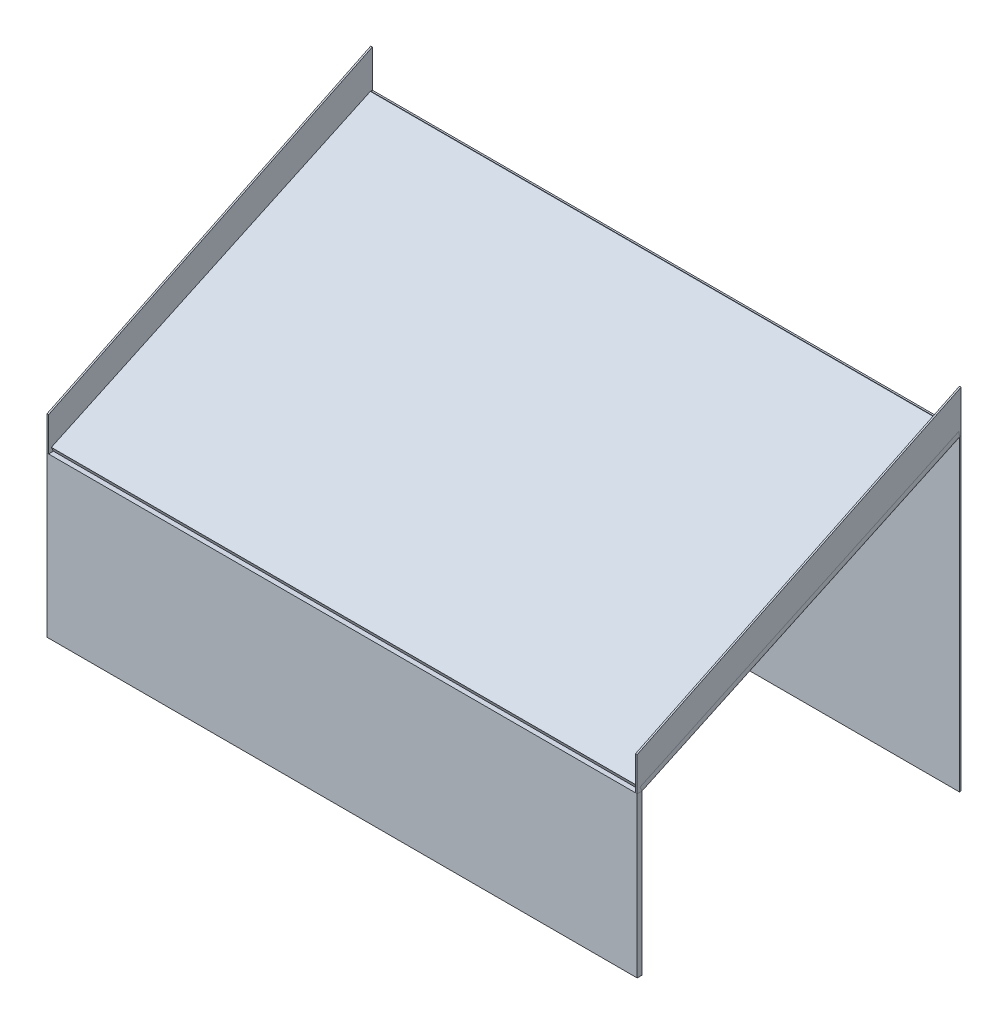
ISO-10303-21;
HEADER;
FILE_DESCRIPTION(('STEP AP214'),'2;1');
FILE_NAME('part.step','',(''),(''),'','','');
FILE_SCHEMA(('AUTOMOTIVE_DESIGN { 1 0 10303 214 1 1 1 1 }'));
ENDSEC;
DATA;
#1=APPLICATION_CONTEXT('core data for automotive mechanical design processes');
#2=APPLICATION_PROTOCOL_DEFINITION('international standard','automotive_design',2000,#1);
#3=PRODUCT_CONTEXT('',#1,'mechanical');
#4=PRODUCT('Part','Part','',(#3));
#5=PRODUCT_RELATED_PRODUCT_CATEGORY('part','',(#4));
#6=PRODUCT_DEFINITION_FORMATION('','',#4);
#7=PRODUCT_DEFINITION_CONTEXT('part definition',#1,'design');
#8=PRODUCT_DEFINITION('design','',#6,#7);
#9=PRODUCT_DEFINITION_SHAPE('','',#8);
#10=(LENGTH_UNIT() NAMED_UNIT(*) SI_UNIT(.MILLI.,.METRE.));
#11=(NAMED_UNIT(*) PLANE_ANGLE_UNIT() SI_UNIT($,.RADIAN.));
#12=(NAMED_UNIT(*) SI_UNIT($,.STERADIAN.) SOLID_ANGLE_UNIT());
#13=UNCERTAINTY_MEASURE_WITH_UNIT(LENGTH_MEASURE(1.E-05),#10,'distance_accuracy_value','');
#14=(GEOMETRIC_REPRESENTATION_CONTEXT(3) GLOBAL_UNCERTAINTY_ASSIGNED_CONTEXT((#13)) GLOBAL_UNIT_ASSIGNED_CONTEXT((#10,
#11,#12)) REPRESENTATION_CONTEXT('',''));
#15=CARTESIAN_POINT('',(0.,0.,0.));
#16=DIRECTION('',(0.,0.,1.));
#17=DIRECTION('',(1.,0.,0.));
#18=AXIS2_PLACEMENT_3D('',#15,#16,#17);
#19=CARTESIAN_POINT('',(-184.,121.325535704581,103.));
#20=DIRECTION('',(0.,0.,1.));
#21=DIRECTION('',(1.,0.,0.));
#22=AXIS2_PLACEMENT_3D('',#19,#20,#21);
#23=PLANE('',#22);
#24=DIRECTION('',(0.,1.,0.));
#25=VECTOR('',#24,1.);
#26=CARTESIAN_POINT('',(-185.,121.325535704581,103.));
#27=LINE('',#26,#25);
#28=CARTESIAN_POINT('',(-185.,100.,103.));
#29=VERTEX_POINT('',#28);
#30=CARTESIAN_POINT('',(-185.,121.325535704581,103.));
#31=VERTEX_POINT('',#30);
#32=EDGE_CURVE('E123',#29,#31,#27,.T.);
#33=ORIENTED_EDGE('',*,*,#32,.F.);
#34=DIRECTION('',(-1.,0.,0.));
#35=VECTOR('',#34,1.);
#36=CARTESIAN_POINT('',(-184.,100.,103.));
#37=LINE('',#36,#35);
#38=CARTESIAN_POINT('',(-184.,100.,103.));
#39=VERTEX_POINT('',#38);
#40=EDGE_CURVE('E12',#39,#29,#37,.T.);
#41=ORIENTED_EDGE('',*,*,#40,.F.);
#42=DIRECTION('',(0.,1.,0.));
#43=VECTOR('',#42,1.);
#44=CARTESIAN_POINT('',(-184.,121.325535704581,103.));
#45=LINE('',#44,#43);
#46=CARTESIAN_POINT('',(-184.,121.325535704581,103.));
#47=VERTEX_POINT('',#46);
#48=EDGE_CURVE('E118',#39,#47,#45,.T.);
#49=ORIENTED_EDGE('',*,*,#48,.T.);
#50=DIRECTION('',(-1.,0.,0.));
#51=VECTOR('',#50,1.);
#52=CARTESIAN_POINT('',(-184.,121.325535704581,103.));
#53=LINE('',#52,#51);
#54=EDGE_CURVE('E49',#47,#31,#53,.T.);
#55=ORIENTED_EDGE('',*,*,#54,.T.);
#56=EDGE_LOOP('',(#33,#41,#49,#55));
#57=FACE_BOUND('',#56,.T.);
#58=ADVANCED_FACE('F46',(#57),#23,.T.);
#59=CARTESIAN_POINT('',(-184.,100.,103.));
#60=DIRECTION('',(0.,-1.,0.));
#61=DIRECTION('',(0.,0.,-1.));
#62=AXIS2_PLACEMENT_3D('',#59,#60,#61);
#63=PLANE('',#62);
#64=DIRECTION('',(0.,0.,1.));
#65=VECTOR('',#64,1.);
#66=CARTESIAN_POINT('',(-185.,100.,103.));
#67=LINE('',#66,#65);
#68=CARTESIAN_POINT('',(-185.,100.,100.));
#69=VERTEX_POINT('',#68);
#70=EDGE_CURVE('E132',#69,#29,#67,.T.);
#71=ORIENTED_EDGE('',*,*,#70,.F.);
#72=DIRECTION('',(-1.,0.,0.));
#73=VECTOR('',#72,1.);
#74=CARTESIAN_POINT('',(-184.,100.,100.));
#75=LINE('',#74,#73);
#76=CARTESIAN_POINT('',(-184.,100.,100.));
#77=VERTEX_POINT('',#76);
#78=EDGE_CURVE('E55',#77,#69,#75,.T.);
#79=ORIENTED_EDGE('',*,*,#78,.F.);
#80=DIRECTION('',(0.,0.,1.));
#81=VECTOR('',#80,1.);
#82=CARTESIAN_POINT('',(-184.,100.,103.));
#83=LINE('',#82,#81);
#84=EDGE_CURVE('E113',#77,#39,#83,.T.);
#85=ORIENTED_EDGE('',*,*,#84,.T.);
#86=ORIENTED_EDGE('',*,*,#40,.T.);
#87=EDGE_LOOP('',(#71,#79,#85,#86));
#88=FACE_BOUND('',#87,.T.);
#89=ADVANCED_FACE('F138',(#88),#63,.T.);
#90=CARTESIAN_POINT('',(-184.,100.,100.));
#91=DIRECTION('',(0.,-0.906614748039815,-0.421959356617084));
#92=DIRECTION('',(0.,0.421959356617084,-0.906614748039815));
#93=AXIS2_PLACEMENT_3D('',#90,#91,#92);
#94=PLANE('',#93);
#95=DIRECTION('',(0.,-0.421959356617084,0.906614748039815));
#96=VECTOR('',#95,1.);
#97=CARTESIAN_POINT('',(-185.,100.,100.));
#98=LINE('',#97,#96);
#99=CARTESIAN_POINT('',(-185.,193.084600163277,-100.));
#100=VERTEX_POINT('',#99);
#101=EDGE_CURVE('E102',#100,#69,#98,.T.);
#102=ORIENTED_EDGE('',*,*,#101,.F.);
#103=DIRECTION('',(-1.,0.,0.));
#104=VECTOR('',#103,1.);
#105=CARTESIAN_POINT('',(-184.,193.084600163277,-100.));
#106=LINE('',#105,#104);
#107=CARTESIAN_POINT('',(-184.,193.084600163277,-100.));
#108=VERTEX_POINT('',#107);
#109=EDGE_CURVE('E97',#108,#100,#106,.T.);
#110=ORIENTED_EDGE('',*,*,#109,.F.);
#111=DIRECTION('',(0.,-0.421959356617084,0.906614748039815));
#112=VECTOR('',#111,1.);
#113=CARTESIAN_POINT('',(-184.,100.,100.));
#114=LINE('',#113,#112);
#115=EDGE_CURVE('E100',#108,#77,#114,.T.);
#116=ORIENTED_EDGE('',*,*,#115,.T.);
#117=ORIENTED_EDGE('',*,*,#78,.T.);
#118=EDGE_LOOP('',(#102,#110,#116,#117));
#119=FACE_BOUND('',#118,.T.);
#120=ADVANCED_FACE('F99',(#119),#94,.T.);
#121=CARTESIAN_POINT('',(-184.,193.084600163277,-100.));
#122=DIRECTION('',(0.,0.,-1.));
#123=DIRECTION('',(-1.,0.,0.));
#124=AXIS2_PLACEMENT_3D('',#121,#122,#123);
#125=PLANE('',#124);
#126=DIRECTION('',(0.,-1.,0.));
#127=VECTOR('',#126,1.);
#128=CARTESIAN_POINT('',(-185.,193.084600163277,-100.));
#129=LINE('',#128,#127);
#130=CARTESIAN_POINT('',(-185.,219.473901999794,-100.));
#131=VERTEX_POINT('',#130);
#132=EDGE_CURVE('E129',#131,#100,#129,.T.);
#133=ORIENTED_EDGE('',*,*,#132,.F.);
#134=DIRECTION('',(-1.,0.,0.));
#135=VECTOR('',#134,1.);
#136=CARTESIAN_POINT('',(-184.,219.473901999794,-100.));
#137=LINE('',#136,#135);
#138=CARTESIAN_POINT('',(-184.,219.473901999794,-100.));
#139=VERTEX_POINT('',#138);
#140=EDGE_CURVE('E107',#139,#131,#137,.T.);
#141=ORIENTED_EDGE('',*,*,#140,.F.);
#142=DIRECTION('',(0.,-1.,0.));
#143=VECTOR('',#142,1.);
#144=CARTESIAN_POINT('',(-184.,193.084600163277,-100.));
#145=LINE('',#144,#143);
#146=EDGE_CURVE('E112',#139,#108,#145,.T.);
#147=ORIENTED_EDGE('',*,*,#146,.T.);
#148=ORIENTED_EDGE('',*,*,#109,.T.);
#149=EDGE_LOOP('',(#133,#141,#147,#148));
#150=FACE_BOUND('',#149,.T.);
#151=ADVANCED_FACE('F115',(#150),#125,.T.);
#152=CARTESIAN_POINT('',(-184.,219.473901999794,-100.));
#153=DIRECTION('',(0.,0.900293863477287,0.435282620127591));
#154=DIRECTION('',(0.,-0.435282620127591,0.900293863477287));
#155=AXIS2_PLACEMENT_3D('',#152,#153,#154);
#156=PLANE('',#155);
#157=DIRECTION('',(0.,0.435282620127591,-0.900293863477287));
#158=VECTOR('',#157,1.);
#159=CARTESIAN_POINT('',(-185.,219.473901999794,-100.));
#160=LINE('',#159,#158);
#161=EDGE_CURVE('E126',#31,#131,#160,.T.);
#162=ORIENTED_EDGE('',*,*,#161,.F.);
#163=ORIENTED_EDGE('',*,*,#54,.F.);
#164=DIRECTION('',(0.,0.435282620127591,-0.900293863477287));
#165=VECTOR('',#164,1.);
#166=CARTESIAN_POINT('',(-184.,219.473901999794,-100.));
#167=LINE('',#166,#165);
#168=EDGE_CURVE('E116',#47,#139,#167,.T.);
#169=ORIENTED_EDGE('',*,*,#168,.T.);
#170=ORIENTED_EDGE('',*,*,#140,.T.);
#171=EDGE_LOOP('',(#162,#163,#169,#170));
#172=FACE_BOUND('',#171,.T.);
#173=ADVANCED_FACE('F135',(#172),#156,.T.);
#174=CARTESIAN_POINT('',(-184.,0.,0.));
#175=DIRECTION('',(1.,0.,0.));
#176=DIRECTION('',(0.,0.,-1.));
#177=AXIS2_PLACEMENT_3D('',#174,#175,#176);
#178=PLANE('',#177);
#179=ORIENTED_EDGE('',*,*,#48,.F.);
#180=ORIENTED_EDGE('',*,*,#84,.F.);
#181=ORIENTED_EDGE('',*,*,#115,.F.);
#182=ORIENTED_EDGE('',*,*,#146,.F.);
#183=ORIENTED_EDGE('',*,*,#168,.F.);
#184=EDGE_LOOP('',(#179,#180,#181,#182,#183));
#185=FACE_BOUND('',#184,.T.);
#186=ADVANCED_FACE('F111',(#185),#178,.T.);
#187=CARTESIAN_POINT('',(-185.,0.,0.));
#188=DIRECTION('',(1.,0.,0.));
#189=DIRECTION('',(0.,0.,-1.));
#190=AXIS2_PLACEMENT_3D('',#187,#188,#189);
#191=PLANE('',#190);
#192=ORIENTED_EDGE('',*,*,#32,.T.);
#193=ORIENTED_EDGE('',*,*,#161,.T.);
#194=ORIENTED_EDGE('',*,*,#132,.T.);
#195=ORIENTED_EDGE('',*,*,#101,.T.);
#196=ORIENTED_EDGE('',*,*,#70,.T.);
#197=EDGE_LOOP('',(#192,#193,#194,#195,#196));
#198=FACE_BOUND('',#197,.T.);
#199=ADVANCED_FACE('F137',(#198),#191,.F.);
#200=CLOSED_SHELL('',(#58,#89,#120,#151,#173,#186,#199));
#201=MANIFOLD_SOLID_BREP('B2',#200);
#202=CARTESIAN_POINT('',(184.,100.,100.));
#203=DIRECTION('',(0.,-1.,0.));
#204=DIRECTION('',(0.,0.,-1.));
#205=AXIS2_PLACEMENT_3D('',#202,#203,#204);
#206=PLANE('',#205);
#207=DIRECTION('',(0.,0.,-1.));
#208=VECTOR('',#207,1.);
#209=CARTESIAN_POINT('',(185.,100.,100.));
#210=LINE('',#209,#208);
#211=CARTESIAN_POINT('',(185.,100.,103.));
#212=VERTEX_POINT('',#211);
#213=CARTESIAN_POINT('',(185.,100.,100.));
#214=VERTEX_POINT('',#213);
#215=EDGE_CURVE('E283',#212,#214,#210,.T.);
#216=ORIENTED_EDGE('',*,*,#215,.F.);
#217=DIRECTION('',(1.,0.,0.));
#218=VECTOR('',#217,1.);
#219=CARTESIAN_POINT('',(184.,100.,103.));
#220=LINE('',#219,#218);
#221=CARTESIAN_POINT('',(184.,100.,103.));
#222=VERTEX_POINT('',#221);
#223=EDGE_CURVE('E44',#222,#212,#220,.T.);
#224=ORIENTED_EDGE('',*,*,#223,.F.);
#225=DIRECTION('',(0.,0.,-1.));
#226=VECTOR('',#225,1.);
#227=CARTESIAN_POINT('',(184.,100.,100.));
#228=LINE('',#227,#226);
#229=CARTESIAN_POINT('',(184.,100.,100.));
#230=VERTEX_POINT('',#229);
#231=EDGE_CURVE('E278',#222,#230,#228,.T.);
#232=ORIENTED_EDGE('',*,*,#231,.T.);
#233=DIRECTION('',(1.,0.,0.));
#234=VECTOR('',#233,1.);
#235=CARTESIAN_POINT('',(184.,100.,100.));
#236=LINE('',#235,#234);
#237=EDGE_CURVE('E209',#230,#214,#236,.T.);
#238=ORIENTED_EDGE('',*,*,#237,.T.);
#239=EDGE_LOOP('',(#216,#224,#232,#238));
#240=FACE_BOUND('',#239,.T.);
#241=ADVANCED_FACE('F206',(#240),#206,.T.);
#242=CARTESIAN_POINT('',(184.,100.,103.));
#243=DIRECTION('',(0.,0.,1.));
#244=DIRECTION('',(1.,0.,0.));
#245=AXIS2_PLACEMENT_3D('',#242,#243,#244);
#246=PLANE('',#245);
#247=DIRECTION('',(0.,-1.,0.));
#248=VECTOR('',#247,1.);
#249=CARTESIAN_POINT('',(185.,100.,103.));
#250=LINE('',#249,#248);
#251=CARTESIAN_POINT('',(185.,121.325535704581,103.));
#252=VERTEX_POINT('',#251);
#253=EDGE_CURVE('E292',#252,#212,#250,.T.);
#254=ORIENTED_EDGE('',*,*,#253,.F.);
#255=DIRECTION('',(1.,0.,0.));
#256=VECTOR('',#255,1.);
#257=CARTESIAN_POINT('',(184.,121.325535704581,103.));
#258=LINE('',#257,#256);
#259=CARTESIAN_POINT('',(184.,121.325535704581,103.));
#260=VERTEX_POINT('',#259);
#261=EDGE_CURVE('E215',#260,#252,#258,.T.);
#262=ORIENTED_EDGE('',*,*,#261,.F.);
#263=DIRECTION('',(0.,-1.,0.));
#264=VECTOR('',#263,1.);
#265=CARTESIAN_POINT('',(184.,100.,103.));
#266=LINE('',#265,#264);
#267=EDGE_CURVE('E273',#260,#222,#266,.T.);
#268=ORIENTED_EDGE('',*,*,#267,.T.);
#269=ORIENTED_EDGE('',*,*,#223,.T.);
#270=EDGE_LOOP('',(#254,#262,#268,#269));
#271=FACE_BOUND('',#270,.T.);
#272=ADVANCED_FACE('F298',(#271),#246,.T.);
#273=CARTESIAN_POINT('',(184.,121.325535704581,103.));
#274=DIRECTION('',(0.,0.900676274518,0.434490792215872));
#275=DIRECTION('',(0.,-0.434490792215872,0.900676274518));
#276=AXIS2_PLACEMENT_3D('',#273,#274,#275);
#277=PLANE('',#276);
#278=DIRECTION('',(0.,-0.434490792215872,0.900676274518));
#279=VECTOR('',#278,1.);
#280=CARTESIAN_POINT('',(185.,121.325535704581,103.));
#281=LINE('',#280,#279);
#282=CARTESIAN_POINT('',(185.,219.253762877017,-100.));
#283=VERTEX_POINT('',#282);
#284=EDGE_CURVE('E262',#283,#252,#281,.T.);
#285=ORIENTED_EDGE('',*,*,#284,.F.);
#286=DIRECTION('',(1.,0.,0.));
#287=VECTOR('',#286,1.);
#288=CARTESIAN_POINT('',(184.,219.253762877017,-100.));
#289=LINE('',#288,#287);
#290=CARTESIAN_POINT('',(184.,219.253762877017,-100.));
#291=VERTEX_POINT('',#290);
#292=EDGE_CURVE('E257',#291,#283,#289,.T.);
#293=ORIENTED_EDGE('',*,*,#292,.F.);
#294=DIRECTION('',(0.,-0.434490792215872,0.900676274518));
#295=VECTOR('',#294,1.);
#296=CARTESIAN_POINT('',(184.,121.325535704581,103.));
#297=LINE('',#296,#295);
#298=EDGE_CURVE('E260',#291,#260,#297,.T.);
#299=ORIENTED_EDGE('',*,*,#298,.T.);
#300=ORIENTED_EDGE('',*,*,#261,.T.);
#301=EDGE_LOOP('',(#285,#293,#299,#300));
#302=FACE_BOUND('',#301,.T.);
#303=ADVANCED_FACE('F259',(#302),#277,.T.);
#304=CARTESIAN_POINT('',(184.,219.253762877017,-100.));
#305=DIRECTION('',(0.,0.,-1.));
#306=DIRECTION('',(-1.,0.,0.));
#307=AXIS2_PLACEMENT_3D('',#304,#305,#306);
#308=PLANE('',#307);
#309=DIRECTION('',(0.,1.,0.));
#310=VECTOR('',#309,1.);
#311=CARTESIAN_POINT('',(185.,219.253762877017,-100.));
#312=LINE('',#311,#310);
#313=CARTESIAN_POINT('',(185.,193.084600163277,-100.));
#314=VERTEX_POINT('',#313);
#315=EDGE_CURVE('E289',#314,#283,#312,.T.);
#316=ORIENTED_EDGE('',*,*,#315,.F.);
#317=DIRECTION('',(1.,0.,0.));
#318=VECTOR('',#317,1.);
#319=CARTESIAN_POINT('',(184.,193.084600163277,-100.));
#320=LINE('',#319,#318);
#321=CARTESIAN_POINT('',(184.,193.084600163277,-100.));
#322=VERTEX_POINT('',#321);
#323=EDGE_CURVE('E267',#322,#314,#320,.T.);
#324=ORIENTED_EDGE('',*,*,#323,.F.);
#325=DIRECTION('',(0.,1.,0.));
#326=VECTOR('',#325,1.);
#327=CARTESIAN_POINT('',(184.,219.253762877017,-100.));
#328=LINE('',#327,#326);
#329=EDGE_CURVE('E272',#322,#291,#328,.T.);
#330=ORIENTED_EDGE('',*,*,#329,.T.);
#331=ORIENTED_EDGE('',*,*,#292,.T.);
#332=EDGE_LOOP('',(#316,#324,#330,#331));
#333=FACE_BOUND('',#332,.T.);
#334=ADVANCED_FACE('F275',(#333),#308,.T.);
#335=CARTESIAN_POINT('',(184.,193.084600163277,-100.));
#336=DIRECTION('',(0.,-0.906614748039815,-0.421959356617084));
#337=DIRECTION('',(0.,0.421959356617084,-0.906614748039815));
#338=AXIS2_PLACEMENT_3D('',#335,#336,#337);
#339=PLANE('',#338);
#340=DIRECTION('',(0.,0.421959356617084,-0.906614748039815));
#341=VECTOR('',#340,1.);
#342=CARTESIAN_POINT('',(185.,193.084600163277,-100.));
#343=LINE('',#342,#341);
#344=EDGE_CURVE('E286',#214,#314,#343,.T.);
#345=ORIENTED_EDGE('',*,*,#344,.F.);
#346=ORIENTED_EDGE('',*,*,#237,.F.);
#347=DIRECTION('',(0.,0.421959356617084,-0.906614748039815));
#348=VECTOR('',#347,1.);
#349=CARTESIAN_POINT('',(184.,193.084600163277,-100.));
#350=LINE('',#349,#348);
#351=EDGE_CURVE('E276',#230,#322,#350,.T.);
#352=ORIENTED_EDGE('',*,*,#351,.T.);
#353=ORIENTED_EDGE('',*,*,#323,.T.);
#354=EDGE_LOOP('',(#345,#346,#352,#353));
#355=FACE_BOUND('',#354,.T.);
#356=ADVANCED_FACE('F295',(#355),#339,.T.);
#357=CARTESIAN_POINT('',(184.,0.,0.));
#358=DIRECTION('',(-1.,0.,0.));
#359=DIRECTION('',(0.,0.,1.));
#360=AXIS2_PLACEMENT_3D('',#357,#358,#359);
#361=PLANE('',#360);
#362=ORIENTED_EDGE('',*,*,#231,.F.);
#363=ORIENTED_EDGE('',*,*,#267,.F.);
#364=ORIENTED_EDGE('',*,*,#298,.F.);
#365=ORIENTED_EDGE('',*,*,#329,.F.);
#366=ORIENTED_EDGE('',*,*,#351,.F.);
#367=EDGE_LOOP('',(#362,#363,#364,#365,#366));
#368=FACE_BOUND('',#367,.T.);
#369=ADVANCED_FACE('F271',(#368),#361,.T.);
#370=CARTESIAN_POINT('',(185.,0.,0.));
#371=DIRECTION('',(-1.,0.,0.));
#372=DIRECTION('',(0.,0.,1.));
#373=AXIS2_PLACEMENT_3D('',#370,#371,#372);
#374=PLANE('',#373);
#375=ORIENTED_EDGE('',*,*,#215,.T.);
#376=ORIENTED_EDGE('',*,*,#344,.T.);
#377=ORIENTED_EDGE('',*,*,#315,.T.);
#378=ORIENTED_EDGE('',*,*,#284,.T.);
#379=ORIENTED_EDGE('',*,*,#253,.T.);
#380=EDGE_LOOP('',(#375,#376,#377,#378,#379));
#381=FACE_BOUND('',#380,.T.);
#382=ADVANCED_FACE('F297',(#381),#374,.F.);
#383=CLOSED_SHELL('',(#241,#272,#303,#334,#356,#369,#382));
#384=MANIFOLD_SOLID_BREP('B6',#383);
#385=CARTESIAN_POINT('',(-185.,195.980454992108,-98.7321452147779));
#386=DIRECTION('',(0.,-0.422618261740694,0.906307787036652));
#387=DIRECTION('',(0.,-0.906307787036652,-0.422618261740694));
#388=AXIS2_PLACEMENT_3D('',#385,#386,#387);
#389=PLANE('',#388);
#390=DIRECTION('',(1.,0.,0.));
#391=VECTOR('',#390,1.);
#392=CARTESIAN_POINT('',(-185.,195.406038551508,-99.));
#393=LINE('',#392,#391);
#394=CARTESIAN_POINT('',(-185.,195.406038551508,-99.));
#395=VERTEX_POINT('',#394);
#396=CARTESIAN_POINT('',(185.,195.406038551508,-99.));
#397=VERTEX_POINT('',#396);
#398=EDGE_CURVE('E384',#395,#397,#393,.T.);
#399=ORIENTED_EDGE('',*,*,#398,.F.);
#400=DIRECTION('',(0.,-0.906307787036652,-0.422618261740694));
#401=VECTOR('',#400,1.);
#402=CARTESIAN_POINT('',(-185.,195.980454992108,-98.7321452147779));
#403=LINE('',#402,#401);
#404=CARTESIAN_POINT('',(-185.,195.980454992108,-98.7321452147779));
#405=VERTEX_POINT('',#404);
#406=EDGE_CURVE('E495',#405,#395,#403,.T.);
#407=ORIENTED_EDGE('',*,*,#406,.F.);
#408=DIRECTION('',(-1.,0.,0.));
#409=VECTOR('',#408,1.);
#410=CARTESIAN_POINT('',(-185.,195.980454992108,-98.7321452147779));
#411=LINE('',#410,#409);
#412=CARTESIAN_POINT('',(185.,195.980454992108,-98.7321452147779));
#413=VERTEX_POINT('',#412);
#414=EDGE_CURVE('E493',#413,#405,#411,.T.);
#415=ORIENTED_EDGE('',*,*,#414,.F.);
#416=DIRECTION('',(0.,-0.906307787036652,-0.422618261740694));
#417=VECTOR('',#416,1.);
#418=CARTESIAN_POINT('',(185.,195.980454992108,-98.7321452147779));
#419=LINE('',#418,#417);
#420=EDGE_CURVE('E380',#413,#397,#419,.T.);
#421=ORIENTED_EDGE('',*,*,#420,.T.);
#422=EDGE_LOOP('',(#399,#407,#415,#421));
#423=FACE_BOUND('',#422,.T.);
#424=ADVANCED_FACE('F365',(#423),#389,.F.);
#425=CARTESIAN_POINT('',(0.,120.441602640276,56.162841671621));
#426=DIRECTION('',(0.,0.906307787036652,0.422618261740694));
#427=DIRECTION('',(0.,-0.422618261740694,0.906307787036652));
#428=AXIS2_PLACEMENT_3D('',#425,#426,#427);
#429=PLANE('',#428);
#430=DIRECTION('',(-1.,0.,0.));
#431=VECTOR('',#430,1.);
#432=CARTESIAN_POINT('',(0.,192.795223972843,-99.));
#433=LINE('',#432,#431);
#434=CARTESIAN_POINT('',(185.,192.795223972843,-99.));
#435=VERTEX_POINT('',#434);
#436=CARTESIAN_POINT('',(-185.,192.795223972843,-99.));
#437=VERTEX_POINT('',#436);
#438=EDGE_CURVE('E204',#435,#437,#433,.T.);
#439=ORIENTED_EDGE('',*,*,#438,.F.);
#440=DIRECTION('',(0.,0.422618261740694,-0.906307787036652));
#441=VECTOR('',#440,1.);
#442=CARTESIAN_POINT('',(185.,193.261531630998,-100.));
#443=LINE('',#442,#441);
#444=CARTESIAN_POINT('',(185.,99.9999999999999,100.));
#445=VERTEX_POINT('',#444);
#446=EDGE_CURVE('E444',#445,#435,#443,.T.);
#447=ORIENTED_EDGE('',*,*,#446,.F.);
#448=DIRECTION('',(1.,0.,0.));
#449=VECTOR('',#448,1.);
#450=CARTESIAN_POINT('',(-185.,99.9999999999999,100.));
#451=LINE('',#450,#449);
#452=CARTESIAN_POINT('',(-185.,99.9999999999999,100.));
#453=VERTEX_POINT('',#452);
#454=EDGE_CURVE('E497',#453,#445,#451,.T.);
#455=ORIENTED_EDGE('',*,*,#454,.F.);
#456=DIRECTION('',(0.,-0.422618261740694,0.906307787036652));
#457=VECTOR('',#456,1.);
#458=CARTESIAN_POINT('',(-185.,193.261531630998,-100.));
#459=LINE('',#458,#457);
#460=EDGE_CURVE('E485',#437,#453,#459,.T.);
#461=ORIENTED_EDGE('',*,*,#460,.F.);
#462=EDGE_LOOP('',(#439,#447,#455,#461));
#463=FACE_BOUND('',#462,.T.);
#464=ADVANCED_FACE('F512',(#463),#429,.F.);
#465=CARTESIAN_POINT('',(-185.,195.980454992108,-98.7321452147779));
#466=DIRECTION('',(1.,0.,0.));
#467=DIRECTION('',(0.,0.,-1.));
#468=AXIS2_PLACEMENT_3D('',#465,#466,#467);
#469=PLANE('',#468);
#470=DIRECTION('',(0.,1.,0.));
#471=VECTOR('',#470,1.);
#472=CARTESIAN_POINT('',(-185.,195.980454992108,-99.));
#473=LINE('',#472,#471);
#474=CARTESIAN_POINT('',(-185.,0.,-99.));
#475=VERTEX_POINT('',#474);
#476=EDGE_CURVE('E462',#475,#437,#473,.T.);
#477=ORIENTED_EDGE('',*,*,#476,.T.);
#478=ORIENTED_EDGE('',*,*,#460,.T.);
#479=DIRECTION('',(0.,-0.906307787036652,-0.422618261740694));
#480=VECTOR('',#479,1.);
#481=CARTESIAN_POINT('',(-185.,102.71892336111,101.267854785222));
#482=LINE('',#481,#480);
#483=CARTESIAN_POINT('',(-185.,102.71892336111,101.267854785222));
#484=VERTEX_POINT('',#483);
#485=EDGE_CURVE('E373',#484,#453,#482,.T.);
#486=ORIENTED_EDGE('',*,*,#485,.F.);
#487=DIRECTION('',(0.,-0.422618261740694,0.906307787036652));
#488=VECTOR('',#487,1.);
#489=CARTESIAN_POINT('',(-185.,195.980454992108,-98.7321452147779));
#490=LINE('',#489,#488);
#491=EDGE_CURVE('E486',#405,#484,#490,.T.);
#492=ORIENTED_EDGE('',*,*,#491,.F.);
#493=ORIENTED_EDGE('',*,*,#406,.T.);
#494=CARTESIAN_POINT('',(-185.,195.980454992108,-99.));
#495=VERTEX_POINT('',#494);
#496=EDGE_CURVE('E463',#395,#495,#473,.T.);
#497=ORIENTED_EDGE('',*,*,#496,.T.);
#498=DIRECTION('',(0.,0.,-1.));
#499=VECTOR('',#498,1.);
#500=CARTESIAN_POINT('',(-185.,195.980454992108,-99.));
#501=LINE('',#500,#499);
#502=CARTESIAN_POINT('',(-185.,195.980454992108,-100.));
#503=VERTEX_POINT('',#502);
#504=EDGE_CURVE('E480',#495,#503,#501,.T.);
#505=ORIENTED_EDGE('',*,*,#504,.T.);
#506=DIRECTION('',(0.,1.,0.));
#507=VECTOR('',#506,1.);
#508=CARTESIAN_POINT('',(-185.,195.980454992108,-100.));
#509=LINE('',#508,#507);
#510=CARTESIAN_POINT('',(-185.,0.,-100.));
#511=VERTEX_POINT('',#510);
#512=EDGE_CURVE('E473',#511,#503,#509,.T.);
#513=ORIENTED_EDGE('',*,*,#512,.F.);
#514=DIRECTION('',(0.,0.,-1.));
#515=VECTOR('',#514,1.);
#516=CARTESIAN_POINT('',(-185.,0.,-99.));
#517=LINE('',#516,#515);
#518=EDGE_CURVE('E456',#475,#511,#517,.T.);
#519=ORIENTED_EDGE('',*,*,#518,.F.);
#520=EDGE_LOOP('',(#477,#478,#486,#492,#493,#497,#505,#513,#519));
#521=FACE_BOUND('',#520,.T.);
#522=ADVANCED_FACE('F367',(#521),#469,.F.);
#523=CARTESIAN_POINT('',(-185.,102.71892336111,101.267854785222));
#524=DIRECTION('',(0.,0.422618261740694,-0.906307787036652));
#525=DIRECTION('',(0.,0.906307787036652,0.422618261740694));
#526=AXIS2_PLACEMENT_3D('',#523,#524,#525);
#527=PLANE('',#526);
#528=ORIENTED_EDGE('',*,*,#454,.T.);
#529=DIRECTION('',(0.,-0.906307787036652,-0.422618261740694));
#530=VECTOR('',#529,1.);
#531=CARTESIAN_POINT('',(185.,102.71892336111,101.267854785222));
#532=LINE('',#531,#530);
#533=CARTESIAN_POINT('',(185.,102.71892336111,101.267854785222));
#534=VERTEX_POINT('',#533);
#535=EDGE_CURVE('E502',#534,#445,#532,.T.);
#536=ORIENTED_EDGE('',*,*,#535,.F.);
#537=DIRECTION('',(1.,0.,0.));
#538=VECTOR('',#537,1.);
#539=CARTESIAN_POINT('',(-185.,102.71892336111,101.267854785222));
#540=LINE('',#539,#538);
#541=EDGE_CURVE('E489',#484,#534,#540,.T.);
#542=ORIENTED_EDGE('',*,*,#541,.F.);
#543=ORIENTED_EDGE('',*,*,#485,.T.);
#544=EDGE_LOOP('',(#528,#536,#542,#543));
#545=FACE_BOUND('',#544,.T.);
#546=ADVANCED_FACE('F506',(#545),#527,.F.);
#547=CARTESIAN_POINT('',(185.,195.980454992108,-98.7321452147779));
#548=DIRECTION('',(-1.,0.,0.));
#549=DIRECTION('',(0.,0.,1.));
#550=AXIS2_PLACEMENT_3D('',#547,#548,#549);
#551=PLANE('',#550);
#552=DIRECTION('',(0.,-1.,0.));
#553=VECTOR('',#552,1.);
#554=CARTESIAN_POINT('',(185.,195.980454992108,-100.));
#555=LINE('',#554,#553);
#556=CARTESIAN_POINT('',(185.,195.980454992108,-100.));
#557=VERTEX_POINT('',#556);
#558=CARTESIAN_POINT('',(185.,0.,-100.));
#559=VERTEX_POINT('',#558);
#560=EDGE_CURVE('E470',#557,#559,#555,.T.);
#561=ORIENTED_EDGE('',*,*,#560,.F.);
#562=DIRECTION('',(0.,0.,-1.));
#563=VECTOR('',#562,1.);
#564=CARTESIAN_POINT('',(185.,195.980454992108,-99.));
#565=LINE('',#564,#563);
#566=CARTESIAN_POINT('',(185.,195.980454992108,-99.));
#567=VERTEX_POINT('',#566);
#568=EDGE_CURVE('E477',#567,#557,#565,.T.);
#569=ORIENTED_EDGE('',*,*,#568,.F.);
#570=DIRECTION('',(0.,-1.,0.));
#571=VECTOR('',#570,1.);
#572=CARTESIAN_POINT('',(185.,195.980454992108,-99.));
#573=LINE('',#572,#571);
#574=EDGE_CURVE('E447',#567,#397,#573,.T.);
#575=ORIENTED_EDGE('',*,*,#574,.T.);
#576=ORIENTED_EDGE('',*,*,#420,.F.);
#577=DIRECTION('',(0.,0.422618261740694,-0.906307787036652));
#578=VECTOR('',#577,1.);
#579=CARTESIAN_POINT('',(185.,195.980454992108,-98.7321452147779));
#580=LINE('',#579,#578);
#581=EDGE_CURVE('E491',#534,#413,#580,.T.);
#582=ORIENTED_EDGE('',*,*,#581,.F.);
#583=ORIENTED_EDGE('',*,*,#535,.T.);
#584=ORIENTED_EDGE('',*,*,#446,.T.);
#585=CARTESIAN_POINT('',(185.,0.,-99.));
#586=VERTEX_POINT('',#585);
#587=EDGE_CURVE('E437',#435,#586,#573,.T.);
#588=ORIENTED_EDGE('',*,*,#587,.T.);
#589=DIRECTION('',(0.,0.,-1.));
#590=VECTOR('',#589,1.);
#591=CARTESIAN_POINT('',(185.,0.,-99.));
#592=LINE('',#591,#590);
#593=EDGE_CURVE('E440',#586,#559,#592,.T.);
#594=ORIENTED_EDGE('',*,*,#593,.T.);
#595=EDGE_LOOP('',(#561,#569,#575,#576,#582,#583,#584,#588,#594));
#596=FACE_BOUND('',#595,.T.);
#597=ADVANCED_FACE('F439',(#596),#551,.F.);
#598=CARTESIAN_POINT('',(0.,123.160526001386,57.4306964568431));
#599=DIRECTION('',(0.,0.906307787036652,0.422618261740694));
#600=DIRECTION('',(0.,-0.422618261740694,0.906307787036652));
#601=AXIS2_PLACEMENT_3D('',#598,#599,#600);
#602=PLANE('',#601);
#603=ORIENTED_EDGE('',*,*,#491,.T.);
#604=ORIENTED_EDGE('',*,*,#541,.T.);
#605=ORIENTED_EDGE('',*,*,#581,.T.);
#606=ORIENTED_EDGE('',*,*,#414,.T.);
#607=EDGE_LOOP('',(#603,#604,#605,#606));
#608=FACE_BOUND('',#607,.T.);
#609=ADVANCED_FACE('F521',(#608),#602,.T.);
#610=CARTESIAN_POINT('',(0.,0.,-99.));
#611=DIRECTION('',(0.,0.,-1.));
#612=DIRECTION('',(-1.,0.,0.));
#613=AXIS2_PLACEMENT_3D('',#610,#611,#612);
#614=PLANE('',#613);
#615=ORIENTED_EDGE('',*,*,#496,.F.);
#616=ORIENTED_EDGE('',*,*,#398,.T.);
#617=ORIENTED_EDGE('',*,*,#574,.F.);
#618=DIRECTION('',(1.,0.,0.));
#619=VECTOR('',#618,1.);
#620=CARTESIAN_POINT('',(185.,195.980454992108,-99.));
#621=LINE('',#620,#619);
#622=EDGE_CURVE('E457',#495,#567,#621,.T.);
#623=ORIENTED_EDGE('',*,*,#622,.F.);
#624=EDGE_LOOP('',(#615,#616,#617,#623));
#625=FACE_BOUND('',#624,.T.);
#626=ADVANCED_FACE('F541',(#625),#614,.F.);
#627=ORIENTED_EDGE('',*,*,#587,.F.);
#628=ORIENTED_EDGE('',*,*,#438,.T.);
#629=ORIENTED_EDGE('',*,*,#476,.F.);
#630=DIRECTION('',(-1.,0.,0.));
#631=VECTOR('',#630,1.);
#632=CARTESIAN_POINT('',(185.,0.,-99.));
#633=LINE('',#632,#631);
#634=EDGE_CURVE('E453',#586,#475,#633,.T.);
#635=ORIENTED_EDGE('',*,*,#634,.F.);
#636=EDGE_LOOP('',(#627,#628,#629,#635));
#637=FACE_BOUND('',#636,.T.);
#638=ADVANCED_FACE('F460',(#637),#614,.F.);
#639=CARTESIAN_POINT('',(0.,0.,-100.));
#640=DIRECTION('',(0.,0.,-1.));
#641=DIRECTION('',(-1.,0.,0.));
#642=AXIS2_PLACEMENT_3D('',#639,#640,#641);
#643=PLANE('',#642);
#644=ORIENTED_EDGE('',*,*,#512,.T.);
#645=DIRECTION('',(1.,0.,0.));
#646=VECTOR('',#645,1.);
#647=CARTESIAN_POINT('',(185.,195.980454992108,-100.));
#648=LINE('',#647,#646);
#649=EDGE_CURVE('E448',#503,#557,#648,.T.);
#650=ORIENTED_EDGE('',*,*,#649,.T.);
#651=ORIENTED_EDGE('',*,*,#560,.T.);
#652=DIRECTION('',(-1.,0.,0.));
#653=VECTOR('',#652,1.);
#654=CARTESIAN_POINT('',(185.,0.,-100.));
#655=LINE('',#654,#653);
#656=EDGE_CURVE('E455',#559,#511,#655,.T.);
#657=ORIENTED_EDGE('',*,*,#656,.T.);
#658=EDGE_LOOP('',(#644,#650,#651,#657));
#659=FACE_BOUND('',#658,.T.);
#660=ADVANCED_FACE('F555',(#659),#643,.T.);
#661=CARTESIAN_POINT('',(185.,195.980454992108,-99.));
#662=DIRECTION('',(0.,1.,0.));
#663=DIRECTION('',(0.,0.,1.));
#664=AXIS2_PLACEMENT_3D('',#661,#662,#663);
#665=PLANE('',#664);
#666=ORIENTED_EDGE('',*,*,#649,.F.);
#667=ORIENTED_EDGE('',*,*,#504,.F.);
#668=ORIENTED_EDGE('',*,*,#622,.T.);
#669=ORIENTED_EDGE('',*,*,#568,.T.);
#670=EDGE_LOOP('',(#666,#667,#668,#669));
#671=FACE_BOUND('',#670,.T.);
#672=ADVANCED_FACE('F561',(#671),#665,.T.);
#673=CARTESIAN_POINT('',(185.,0.,-99.));
#674=DIRECTION('',(0.,-1.,0.));
#675=DIRECTION('',(0.,0.,-1.));
#676=AXIS2_PLACEMENT_3D('',#673,#674,#675);
#677=PLANE('',#676);
#678=ORIENTED_EDGE('',*,*,#656,.F.);
#679=ORIENTED_EDGE('',*,*,#593,.F.);
#680=ORIENTED_EDGE('',*,*,#634,.T.);
#681=ORIENTED_EDGE('',*,*,#518,.T.);
#682=EDGE_LOOP('',(#678,#679,#680,#681));
#683=FACE_BOUND('',#682,.T.);
#684=ADVANCED_FACE('F452',(#683),#677,.T.);
#685=CLOSED_SHELL('',(#424,#464,#522,#546,#597,#609,#626,#638,#660,#672,#684));
#686=MANIFOLD_SOLID_BREP('B38',#685);
#687=CARTESIAN_POINT('',(0.,0.,100.));
#688=DIRECTION('',(0.,0.,1.));
#689=DIRECTION('',(1.,0.,0.));
#690=AXIS2_PLACEMENT_3D('',#687,#688,#689);
#691=PLANE('',#690);
#692=DIRECTION('',(0.,-1.,0.));
#693=VECTOR('',#692,1.);
#694=CARTESIAN_POINT('',(-185.,0.,100.));
#695=LINE('',#694,#693);
#696=CARTESIAN_POINT('',(-185.,100.,100.));
#697=VERTEX_POINT('',#696);
#698=CARTESIAN_POINT('',(-185.,0.,100.));
#699=VERTEX_POINT('',#698);
#700=EDGE_CURVE('E664',#697,#699,#695,.T.);
#701=ORIENTED_EDGE('',*,*,#700,.F.);
#702=DIRECTION('',(-1.,0.,0.));
#703=VECTOR('',#702,1.);
#704=CARTESIAN_POINT('',(-185.,100.,100.));
#705=LINE('',#704,#703);
#706=CARTESIAN_POINT('',(185.,100.,100.));
#707=VERTEX_POINT('',#706);
#708=EDGE_CURVE('E671',#707,#697,#705,.T.);
#709=ORIENTED_EDGE('',*,*,#708,.F.);
#710=DIRECTION('',(0.,-1.,0.));
#711=VECTOR('',#710,1.);
#712=CARTESIAN_POINT('',(185.,0.,100.));
#713=LINE('',#712,#711);
#714=CARTESIAN_POINT('',(185.,0.,100.));
#715=VERTEX_POINT('',#714);
#716=EDGE_CURVE('E666',#707,#715,#713,.T.);
#717=ORIENTED_EDGE('',*,*,#716,.T.);
#718=DIRECTION('',(1.,0.,0.));
#719=VECTOR('',#718,1.);
#720=CARTESIAN_POINT('',(-185.,0.,100.));
#721=LINE('',#720,#719);
#722=EDGE_CURVE('E662',#699,#715,#721,.T.);
#723=ORIENTED_EDGE('',*,*,#722,.F.);
#724=EDGE_LOOP('',(#701,#709,#717,#723));
#725=FACE_BOUND('',#724,.T.);
#726=ADVANCED_FACE('F622',(#725),#691,.F.);
#727=CARTESIAN_POINT('',(-185.,100.,0.));
#728=DIRECTION('',(1.,0.,0.));
#729=DIRECTION('',(0.,0.,-1.));
#730=AXIS2_PLACEMENT_3D('',#727,#728,#729);
#731=PLANE('',#730);
#732=DIRECTION('',(0.,0.,1.));
#733=VECTOR('',#732,1.);
#734=CARTESIAN_POINT('',(-185.,100.,0.));
#735=LINE('',#734,#733);
#736=CARTESIAN_POINT('',(-185.,100.,103.));
#737=VERTEX_POINT('',#736);
#738=EDGE_CURVE('E363',#697,#737,#735,.T.);
#739=ORIENTED_EDGE('',*,*,#738,.F.);
#740=ORIENTED_EDGE('',*,*,#700,.T.);
#741=DIRECTION('',(0.,0.,1.));
#742=VECTOR('',#741,1.);
#743=CARTESIAN_POINT('',(-185.,0.,0.));
#744=LINE('',#743,#742);
#745=CARTESIAN_POINT('',(-185.,0.,103.));
#746=VERTEX_POINT('',#745);
#747=EDGE_CURVE('E626',#699,#746,#744,.T.);
#748=ORIENTED_EDGE('',*,*,#747,.T.);
#749=DIRECTION('',(0.,-1.,0.));
#750=VECTOR('',#749,1.);
#751=CARTESIAN_POINT('',(-185.,100.,103.));
#752=LINE('',#751,#750);
#753=EDGE_CURVE('E688',#737,#746,#752,.T.);
#754=ORIENTED_EDGE('',*,*,#753,.F.);
#755=EDGE_LOOP('',(#739,#740,#748,#754));
#756=FACE_BOUND('',#755,.T.);
#757=ADVANCED_FACE('F624',(#756),#731,.F.);
#758=CARTESIAN_POINT('',(0.,100.,0.));
#759=DIRECTION('',(0.,1.,0.));
#760=DIRECTION('',(0.,0.,1.));
#761=AXIS2_PLACEMENT_3D('',#758,#759,#760);
#762=PLANE('',#761);
#763=ORIENTED_EDGE('',*,*,#708,.T.);
#764=ORIENTED_EDGE('',*,*,#738,.T.);
#765=DIRECTION('',(-1.,0.,0.));
#766=VECTOR('',#765,1.);
#767=CARTESIAN_POINT('',(-185.,100.,103.));
#768=LINE('',#767,#766);
#769=CARTESIAN_POINT('',(185.,100.,103.));
#770=VERTEX_POINT('',#769);
#771=EDGE_CURVE('E685',#770,#737,#768,.T.);
#772=ORIENTED_EDGE('',*,*,#771,.F.);
#773=DIRECTION('',(0.,0.,-1.));
#774=VECTOR('',#773,1.);
#775=CARTESIAN_POINT('',(185.,100.,103.));
#776=LINE('',#775,#774);
#777=EDGE_CURVE('E681',#770,#707,#776,.T.);
#778=ORIENTED_EDGE('',*,*,#777,.T.);
#779=EDGE_LOOP('',(#763,#764,#772,#778));
#780=FACE_BOUND('',#779,.T.);
#781=ADVANCED_FACE('F695',(#780),#762,.T.);
#782=CARTESIAN_POINT('',(0.,0.,0.));
#783=DIRECTION('',(0.,1.,0.));
#784=DIRECTION('',(0.,0.,1.));
#785=AXIS2_PLACEMENT_3D('',#782,#783,#784);
#786=PLANE('',#785);
#787=ORIENTED_EDGE('',*,*,#747,.F.);
#788=ORIENTED_EDGE('',*,*,#722,.T.);
#789=DIRECTION('',(0.,0.,-1.));
#790=VECTOR('',#789,1.);
#791=CARTESIAN_POINT('',(185.,0.,103.));
#792=LINE('',#791,#790);
#793=CARTESIAN_POINT('',(185.,0.,103.));
#794=VERTEX_POINT('',#793);
#795=EDGE_CURVE('E680',#794,#715,#792,.T.);
#796=ORIENTED_EDGE('',*,*,#795,.F.);
#797=DIRECTION('',(1.,0.,0.));
#798=VECTOR('',#797,1.);
#799=CARTESIAN_POINT('',(-185.,0.,103.));
#800=LINE('',#799,#798);
#801=EDGE_CURVE('E678',#746,#794,#800,.T.);
#802=ORIENTED_EDGE('',*,*,#801,.F.);
#803=EDGE_LOOP('',(#787,#788,#796,#802));
#804=FACE_BOUND('',#803,.T.);
#805=ADVANCED_FACE('F677',(#804),#786,.F.);
#806=CARTESIAN_POINT('',(185.,100.,103.));
#807=DIRECTION('',(-1.,0.,0.));
#808=DIRECTION('',(0.,0.,1.));
#809=AXIS2_PLACEMENT_3D('',#806,#807,#808);
#810=PLANE('',#809);
#811=ORIENTED_EDGE('',*,*,#795,.T.);
#812=ORIENTED_EDGE('',*,*,#716,.F.);
#813=ORIENTED_EDGE('',*,*,#777,.F.);
#814=DIRECTION('',(0.,1.,0.));
#815=VECTOR('',#814,1.);
#816=CARTESIAN_POINT('',(185.,100.,103.));
#817=LINE('',#816,#815);
#818=EDGE_CURVE('E642',#794,#770,#817,.T.);
#819=ORIENTED_EDGE('',*,*,#818,.F.);
#820=EDGE_LOOP('',(#811,#812,#813,#819));
#821=FACE_BOUND('',#820,.T.);
#822=ADVANCED_FACE('F696',(#821),#810,.F.);
#823=CARTESIAN_POINT('',(0.,0.,103.));
#824=DIRECTION('',(0.,0.,1.));
#825=DIRECTION('',(1.,0.,0.));
#826=AXIS2_PLACEMENT_3D('',#823,#824,#825);
#827=PLANE('',#826);
#828=ORIENTED_EDGE('',*,*,#753,.T.);
#829=ORIENTED_EDGE('',*,*,#801,.T.);
#830=ORIENTED_EDGE('',*,*,#818,.T.);
#831=ORIENTED_EDGE('',*,*,#771,.T.);
#832=EDGE_LOOP('',(#828,#829,#830,#831));
#833=FACE_BOUND('',#832,.T.);
#834=ADVANCED_FACE('F694',(#833),#827,.T.);
#835=CLOSED_SHELL('',(#726,#757,#781,#805,#822,#834));
#836=MANIFOLD_SOLID_BREP('B198',#835);
#837=ADVANCED_BREP_SHAPE_REPRESENTATION('',(#18,#201,#384,#686,#836),#14);
#838=SHAPE_DEFINITION_REPRESENTATION(#9,#837);
ENDSEC;
END-ISO-10303-21;
